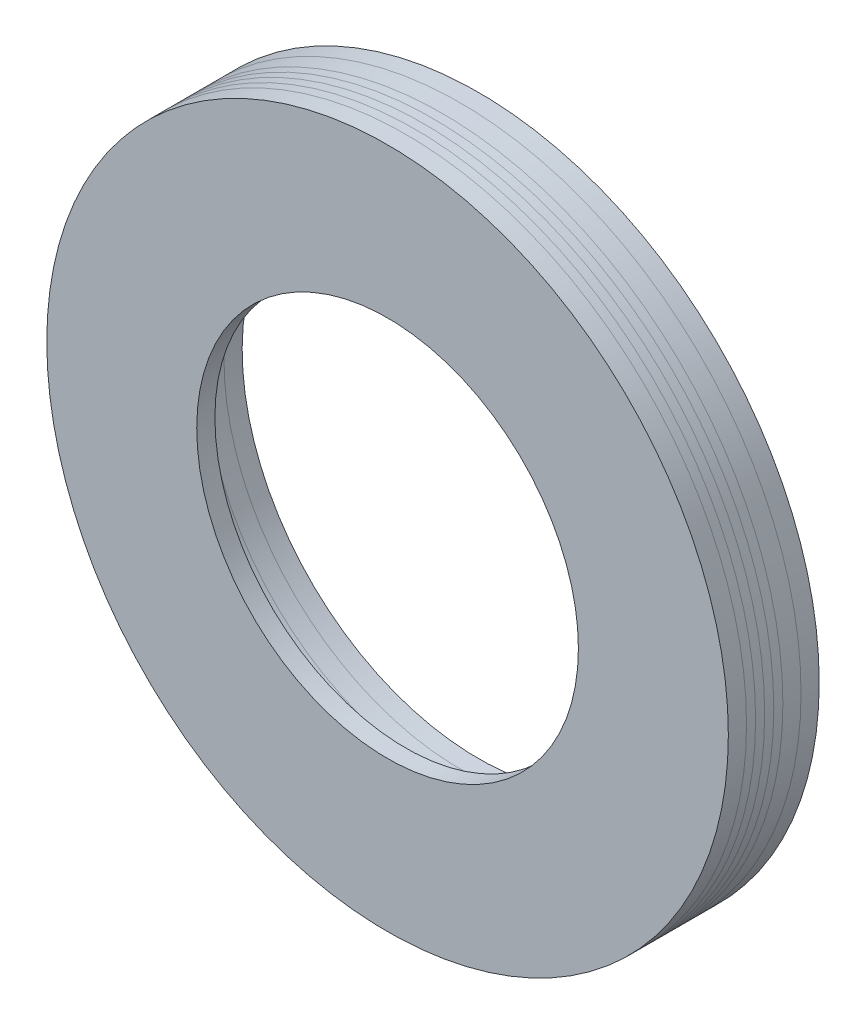
ISO-10303-21;
HEADER;
FILE_DESCRIPTION(('STEP AP214'),'2;1');
FILE_NAME('part.step','',(''),(''),'','','');
FILE_SCHEMA(('AUTOMOTIVE_DESIGN { 1 0 10303 214 1 1 1 1 }'));
ENDSEC;
DATA;
#1=APPLICATION_CONTEXT('core data for automotive mechanical design processes');
#2=APPLICATION_PROTOCOL_DEFINITION('international standard','automotive_design',2000,#1);
#3=PRODUCT_CONTEXT('',#1,'mechanical');
#4=PRODUCT('Part','Part','',(#3));
#5=PRODUCT_RELATED_PRODUCT_CATEGORY('part','',(#4));
#6=PRODUCT_DEFINITION_FORMATION('','',#4);
#7=PRODUCT_DEFINITION_CONTEXT('part definition',#1,'design');
#8=PRODUCT_DEFINITION('design','',#6,#7);
#9=PRODUCT_DEFINITION_SHAPE('','',#8);
#10=(LENGTH_UNIT() NAMED_UNIT(*) SI_UNIT(.MILLI.,.METRE.));
#11=(NAMED_UNIT(*) PLANE_ANGLE_UNIT() SI_UNIT($,.RADIAN.));
#12=(NAMED_UNIT(*) SI_UNIT($,.STERADIAN.) SOLID_ANGLE_UNIT());
#13=UNCERTAINTY_MEASURE_WITH_UNIT(LENGTH_MEASURE(1.E-05),#10,'distance_accuracy_value','');
#14=(GEOMETRIC_REPRESENTATION_CONTEXT(3) GLOBAL_UNCERTAINTY_ASSIGNED_CONTEXT((#13)) GLOBAL_UNIT_ASSIGNED_CONTEXT((#10,
#11,#12)) REPRESENTATION_CONTEXT('',''));
#15=CARTESIAN_POINT('',(0.,0.,0.));
#16=DIRECTION('',(0.,0.,1.));
#17=DIRECTION('',(1.,0.,0.));
#18=AXIS2_PLACEMENT_3D('',#15,#16,#17);
#19=CARTESIAN_POINT('',(0.,0.,5.));
#20=DIRECTION('',(0.,0.,1.));
#21=DIRECTION('',(1.,0.,0.));
#22=AXIS2_PLACEMENT_3D('',#19,#20,#21);
#23=PLANE('',#22);
#24=CARTESIAN_POINT('',(0.,0.,5.));
#25=DIRECTION('',(0.,0.,1.));
#26=DIRECTION('',(1.,0.,0.));
#27=AXIS2_PLACEMENT_3D('',#24,#25,#26);
#28=CIRCLE('',#27,18.75);
#29=CARTESIAN_POINT('',(18.75,0.,5.));
#30=VERTEX_POINT('',#29);
#31=EDGE_CURVE('E11',#30,#30,#28,.T.);
#32=ORIENTED_EDGE('',*,*,#31,.T.);
#33=EDGE_LOOP('',(#32));
#34=FACE_BOUND('',#33,.T.);
#35=CARTESIAN_POINT('',(0.,0.,5.));
#36=DIRECTION('',(0.,0.,1.));
#37=DIRECTION('',(1.,0.,0.));
#38=AXIS2_PLACEMENT_3D('',#35,#36,#37);
#39=CIRCLE('',#38,10.5);
#40=CARTESIAN_POINT('',(10.5,0.,5.));
#41=VERTEX_POINT('',#40);
#42=EDGE_CURVE('E52',#41,#41,#39,.T.);
#43=ORIENTED_EDGE('',*,*,#42,.F.);
#44=EDGE_LOOP('',(#43));
#45=FACE_BOUND('',#44,.T.);
#46=ADVANCED_FACE('F41',(#34,#45),#23,.T.);
#47=CARTESIAN_POINT('',(0.,0.,4.));
#48=DIRECTION('',(0.,0.,1.));
#49=DIRECTION('',(1.,0.,0.));
#50=AXIS2_PLACEMENT_3D('',#47,#48,#49);
#51=PLANE('',#50);
#52=CARTESIAN_POINT('',(0.,0.,4.));
#53=DIRECTION('',(0.,0.,1.));
#54=DIRECTION('',(1.,0.,0.));
#55=AXIS2_PLACEMENT_3D('',#52,#53,#54);
#56=CIRCLE('',#55,18.75);
#57=CARTESIAN_POINT('',(18.75,0.,4.));
#58=VERTEX_POINT('',#57);
#59=EDGE_CURVE('E45',#58,#58,#56,.T.);
#60=ORIENTED_EDGE('',*,*,#59,.F.);
#61=EDGE_LOOP('',(#60));
#62=FACE_BOUND('',#61,.T.);
#63=CARTESIAN_POINT('',(0.,0.,4.));
#64=DIRECTION('',(0.,0.,1.));
#65=DIRECTION('',(1.,0.,0.));
#66=AXIS2_PLACEMENT_3D('',#63,#64,#65);
#67=CIRCLE('',#66,10.5);
#68=CARTESIAN_POINT('',(10.5,0.,4.));
#69=VERTEX_POINT('',#68);
#70=EDGE_CURVE('E54',#69,#69,#67,.T.);
#71=ORIENTED_EDGE('',*,*,#70,.T.);
#72=EDGE_LOOP('',(#71));
#73=FACE_BOUND('',#72,.T.);
#74=ADVANCED_FACE('F64',(#62,#73),#51,.F.);
#75=CARTESIAN_POINT('',(0.,0.,5.));
#76=DIRECTION('',(0.,0.,-1.));
#77=DIRECTION('',(-1.,0.,0.));
#78=AXIS2_PLACEMENT_3D('',#75,#76,#77);
#79=CYLINDRICAL_SURFACE('',#78,18.75);
#80=ORIENTED_EDGE('',*,*,#31,.F.);
#81=EDGE_LOOP('',(#80));
#82=FACE_BOUND('',#81,.T.);
#83=ORIENTED_EDGE('',*,*,#59,.T.);
#84=EDGE_LOOP('',(#83));
#85=FACE_BOUND('',#84,.T.);
#86=ADVANCED_FACE('F43',(#82,#85),#79,.T.);
#87=CARTESIAN_POINT('',(0.,0.,5.));
#88=DIRECTION('',(0.,0.,-1.));
#89=DIRECTION('',(-1.,0.,0.));
#90=AXIS2_PLACEMENT_3D('',#87,#88,#89);
#91=CYLINDRICAL_SURFACE('',#90,10.5);
#92=ORIENTED_EDGE('',*,*,#42,.T.);
#93=EDGE_LOOP('',(#92));
#94=FACE_BOUND('',#93,.T.);
#95=ORIENTED_EDGE('',*,*,#70,.F.);
#96=EDGE_LOOP('',(#95));
#97=FACE_BOUND('',#96,.T.);
#98=ADVANCED_FACE('F60',(#94,#97),#91,.F.);
#99=CLOSED_SHELL('',(#46,#74,#86,#98));
#100=MANIFOLD_SOLID_BREP('B2',#99);
#101=CARTESIAN_POINT('',(-18.75,-18.76,3.5));
#102=DIRECTION('',(0.,0.,1.));
#103=DIRECTION('',(1.,0.,0.));
#104=AXIS2_PLACEMENT_3D('',#101,#102,#103);
#105=PLANE('',#104);
#106=CARTESIAN_POINT('',(0.,0.,3.5));
#107=DIRECTION('',(0.,0.,1.));
#108=DIRECTION('',(1.,0.,0.));
#109=AXIS2_PLACEMENT_3D('',#106,#107,#108);
#110=CIRCLE('',#109,13.);
#111=CARTESIAN_POINT('',(-4.5,12.1963109176505,3.5));
#112=VERTEX_POINT('',#111);
#113=CARTESIAN_POINT('',(4.5,12.1963109176505,3.5));
#114=VERTEX_POINT('',#113);
#115=EDGE_CURVE('E184',#112,#114,#110,.T.);
#116=ORIENTED_EDGE('',*,*,#115,.T.);
#117=DIRECTION('',(0.,1.,0.));
#118=VECTOR('',#117,1.);
#119=CARTESIAN_POINT('',(4.5,16.5,3.5));
#120=LINE('',#119,#118);
#121=CARTESIAN_POINT('',(4.5,16.5,3.5));
#122=VERTEX_POINT('',#121);
#123=EDGE_CURVE('E168',#114,#122,#120,.T.);
#124=ORIENTED_EDGE('',*,*,#123,.T.);
#125=DIRECTION('',(-1.,0.,0.));
#126=VECTOR('',#125,1.);
#127=CARTESIAN_POINT('',(-4.5,16.5,3.5));
#128=LINE('',#127,#126);
#129=CARTESIAN_POINT('',(-4.5,16.5,3.5));
#130=VERTEX_POINT('',#129);
#131=EDGE_CURVE('E164',#122,#130,#128,.T.);
#132=ORIENTED_EDGE('',*,*,#131,.T.);
#133=DIRECTION('',(0.,-1.,0.));
#134=VECTOR('',#133,1.);
#135=CARTESIAN_POINT('',(-4.5,16.5,3.5));
#136=LINE('',#135,#134);
#137=EDGE_CURVE('E154',#130,#112,#136,.T.);
#138=ORIENTED_EDGE('',*,*,#137,.T.);
#139=EDGE_LOOP('',(#116,#124,#132,#138));
#140=FACE_BOUND('',#139,.T.);
#141=CARTESIAN_POINT('',(0.,0.,3.5));
#142=DIRECTION('',(0.,0.,1.));
#143=DIRECTION('',(1.,0.,0.));
#144=AXIS2_PLACEMENT_3D('',#141,#142,#143);
#145=CIRCLE('',#144,18.75);
#146=CARTESIAN_POINT('',(18.75,0.,3.5));
#147=VERTEX_POINT('',#146);
#148=EDGE_CURVE('E116',#147,#147,#145,.T.);
#149=ORIENTED_EDGE('',*,*,#148,.F.);
#150=EDGE_LOOP('',(#149));
#151=FACE_BOUND('',#150,.T.);
#152=ADVANCED_FACE('F112',(#140,#151),#105,.F.);
#153=CARTESIAN_POINT('',(4.5,16.5,4.));
#154=DIRECTION('',(-1.,0.,0.));
#155=DIRECTION('',(0.,-1.,0.));
#156=AXIS2_PLACEMENT_3D('',#153,#154,#155);
#157=PLANE('',#156);
#158=ORIENTED_EDGE('',*,*,#123,.F.);
#159=DIRECTION('',(0.,0.,-1.));
#160=VECTOR('',#159,1.);
#161=CARTESIAN_POINT('',(4.5,12.1963109176505,4.));
#162=LINE('',#161,#160);
#163=CARTESIAN_POINT('',(4.5,12.1963109176505,4.));
#164=VERTEX_POINT('',#163);
#165=EDGE_CURVE('E179',#164,#114,#162,.T.);
#166=ORIENTED_EDGE('',*,*,#165,.F.);
#167=DIRECTION('',(0.,1.,0.));
#168=VECTOR('',#167,1.);
#169=CARTESIAN_POINT('',(4.5,16.5,4.));
#170=LINE('',#169,#168);
#171=CARTESIAN_POINT('',(4.5,16.5,4.));
#172=VERTEX_POINT('',#171);
#173=EDGE_CURVE('E121',#164,#172,#170,.T.);
#174=ORIENTED_EDGE('',*,*,#173,.T.);
#175=DIRECTION('',(0.,0.,-1.));
#176=VECTOR('',#175,1.);
#177=CARTESIAN_POINT('',(4.5,16.5,4.));
#178=LINE('',#177,#176);
#179=EDGE_CURVE('E175',#172,#122,#178,.T.);
#180=ORIENTED_EDGE('',*,*,#179,.T.);
#181=EDGE_LOOP('',(#158,#166,#174,#180));
#182=FACE_BOUND('',#181,.T.);
#183=ADVANCED_FACE('F205',(#182),#157,.T.);
#184=CARTESIAN_POINT('',(0.,0.,4.));
#185=DIRECTION('',(0.,0.,-1.));
#186=DIRECTION('',(-1.,0.,0.));
#187=AXIS2_PLACEMENT_3D('',#184,#185,#186);
#188=CYLINDRICAL_SURFACE('',#187,13.);
#189=ORIENTED_EDGE('',*,*,#115,.F.);
#190=DIRECTION('',(0.,0.,-1.));
#191=VECTOR('',#190,1.);
#192=CARTESIAN_POINT('',(-4.5,12.1963109176505,4.));
#193=LINE('',#192,#191);
#194=CARTESIAN_POINT('',(-4.5,12.1963109176505,4.));
#195=VERTEX_POINT('',#194);
#196=EDGE_CURVE('E160',#195,#112,#193,.T.);
#197=ORIENTED_EDGE('',*,*,#196,.F.);
#198=CARTESIAN_POINT('',(0.,0.,4.));
#199=DIRECTION('',(0.,0.,1.));
#200=DIRECTION('',(1.,0.,0.));
#201=AXIS2_PLACEMENT_3D('',#198,#199,#200);
#202=CIRCLE('',#201,13.);
#203=EDGE_CURVE('E39',#195,#164,#202,.T.);
#204=ORIENTED_EDGE('',*,*,#203,.T.);
#205=ORIENTED_EDGE('',*,*,#165,.T.);
#206=EDGE_LOOP('',(#189,#197,#204,#205));
#207=FACE_BOUND('',#206,.T.);
#208=ADVANCED_FACE('F196',(#207),#188,.F.);
#209=CARTESIAN_POINT('',(0.,0.,4.));
#210=DIRECTION('',(0.,0.,1.));
#211=DIRECTION('',(1.,0.,0.));
#212=AXIS2_PLACEMENT_3D('',#209,#210,#211);
#213=PLANE('',#212);
#214=CARTESIAN_POINT('',(0.,0.,4.));
#215=DIRECTION('',(0.,0.,1.));
#216=DIRECTION('',(1.,0.,0.));
#217=AXIS2_PLACEMENT_3D('',#214,#215,#216);
#218=CIRCLE('',#217,18.75);
#219=CARTESIAN_POINT('',(18.75,0.,4.));
#220=VERTEX_POINT('',#219);
#221=EDGE_CURVE('E182',#220,#220,#218,.T.);
#222=ORIENTED_EDGE('',*,*,#221,.T.);
#223=EDGE_LOOP('',(#222));
#224=FACE_BOUND('',#223,.T.);
#225=ORIENTED_EDGE('',*,*,#173,.F.);
#226=ORIENTED_EDGE('',*,*,#203,.F.);
#227=DIRECTION('',(0.,-1.,0.));
#228=VECTOR('',#227,1.);
#229=CARTESIAN_POINT('',(-4.5,16.5,4.));
#230=LINE('',#229,#228);
#231=CARTESIAN_POINT('',(-4.5,16.5,4.));
#232=VERTEX_POINT('',#231);
#233=EDGE_CURVE('E177',#232,#195,#230,.T.);
#234=ORIENTED_EDGE('',*,*,#233,.F.);
#235=DIRECTION('',(-1.,0.,0.));
#236=VECTOR('',#235,1.);
#237=CARTESIAN_POINT('',(-4.5,16.5,4.));
#238=LINE('',#237,#236);
#239=EDGE_CURVE('E173',#172,#232,#238,.T.);
#240=ORIENTED_EDGE('',*,*,#239,.F.);
#241=EDGE_LOOP('',(#225,#226,#234,#240));
#242=FACE_BOUND('',#241,.T.);
#243=ADVANCED_FACE('F197',(#224,#242),#213,.T.);
#244=CARTESIAN_POINT('',(-4.5,16.5,4.));
#245=DIRECTION('',(0.,-1.,0.));
#246=DIRECTION('',(0.,0.,-1.));
#247=AXIS2_PLACEMENT_3D('',#244,#245,#246);
#248=PLANE('',#247);
#249=ORIENTED_EDGE('',*,*,#131,.F.);
#250=ORIENTED_EDGE('',*,*,#179,.F.);
#251=ORIENTED_EDGE('',*,*,#239,.T.);
#252=DIRECTION('',(0.,0.,-1.));
#253=VECTOR('',#252,1.);
#254=CARTESIAN_POINT('',(-4.5,16.5,4.));
#255=LINE('',#254,#253);
#256=EDGE_CURVE('E158',#232,#130,#255,.T.);
#257=ORIENTED_EDGE('',*,*,#256,.T.);
#258=EDGE_LOOP('',(#249,#250,#251,#257));
#259=FACE_BOUND('',#258,.T.);
#260=ADVANCED_FACE('F171',(#259),#248,.T.);
#261=CARTESIAN_POINT('',(-4.5,16.5,4.));
#262=DIRECTION('',(1.,0.,0.));
#263=DIRECTION('',(0.,1.,0.));
#264=AXIS2_PLACEMENT_3D('',#261,#262,#263);
#265=PLANE('',#264);
#266=ORIENTED_EDGE('',*,*,#137,.F.);
#267=ORIENTED_EDGE('',*,*,#256,.F.);
#268=ORIENTED_EDGE('',*,*,#233,.T.);
#269=ORIENTED_EDGE('',*,*,#196,.T.);
#270=EDGE_LOOP('',(#266,#267,#268,#269));
#271=FACE_BOUND('',#270,.T.);
#272=ADVANCED_FACE('F156',(#271),#265,.T.);
#273=CARTESIAN_POINT('',(0.,0.,4.));
#274=DIRECTION('',(0.,0.,-1.));
#275=DIRECTION('',(-1.,0.,0.));
#276=AXIS2_PLACEMENT_3D('',#273,#274,#275);
#277=CYLINDRICAL_SURFACE('',#276,18.75);
#278=ORIENTED_EDGE('',*,*,#148,.T.);
#279=EDGE_LOOP('',(#278));
#280=FACE_BOUND('',#279,.T.);
#281=ORIENTED_EDGE('',*,*,#221,.F.);
#282=EDGE_LOOP('',(#281));
#283=FACE_BOUND('',#282,.T.);
#284=ADVANCED_FACE('F114',(#280,#283),#277,.T.);
#285=CLOSED_SHELL('',(#152,#183,#208,#243,#260,#272,#284));
#286=MANIFOLD_SOLID_BREP('B6',#285);
#287=CARTESIAN_POINT('',(-18.75,-18.76,3.));
#288=DIRECTION('',(0.,0.,1.));
#289=DIRECTION('',(1.,0.,0.));
#290=AXIS2_PLACEMENT_3D('',#287,#288,#289);
#291=PLANE('',#290);
#292=CARTESIAN_POINT('',(0.,0.,3.));
#293=DIRECTION('',(0.,0.,1.));
#294=DIRECTION('',(1.,0.,0.));
#295=AXIS2_PLACEMENT_3D('',#292,#293,#294);
#296=CIRCLE('',#295,13.);
#297=CARTESIAN_POINT('',(-4.5,12.1963109176505,3.));
#298=VERTEX_POINT('',#297);
#299=CARTESIAN_POINT('',(4.5,12.1963109176505,3.));
#300=VERTEX_POINT('',#299);
#301=EDGE_CURVE('E338',#298,#300,#296,.T.);
#302=ORIENTED_EDGE('',*,*,#301,.T.);
#303=DIRECTION('',(0.,1.,0.));
#304=VECTOR('',#303,1.);
#305=CARTESIAN_POINT('',(4.5,16.5,3.));
#306=LINE('',#305,#304);
#307=CARTESIAN_POINT('',(4.5,16.5,3.));
#308=VERTEX_POINT('',#307);
#309=EDGE_CURVE('E316',#300,#308,#306,.T.);
#310=ORIENTED_EDGE('',*,*,#309,.T.);
#311=DIRECTION('',(-1.,0.,0.));
#312=VECTOR('',#311,1.);
#313=CARTESIAN_POINT('',(-4.5,16.5,3.));
#314=LINE('',#313,#312);
#315=CARTESIAN_POINT('',(-4.5,16.5,3.));
#316=VERTEX_POINT('',#315);
#317=EDGE_CURVE('E312',#308,#316,#314,.T.);
#318=ORIENTED_EDGE('',*,*,#317,.T.);
#319=DIRECTION('',(0.,-1.,0.));
#320=VECTOR('',#319,1.);
#321=CARTESIAN_POINT('',(-4.5,16.5,3.));
#322=LINE('',#321,#320);
#323=EDGE_CURVE('E304',#316,#298,#322,.T.);
#324=ORIENTED_EDGE('',*,*,#323,.T.);
#325=EDGE_LOOP('',(#302,#310,#318,#324));
#326=FACE_BOUND('',#325,.T.);
#327=CARTESIAN_POINT('',(0.,0.,3.));
#328=DIRECTION('',(0.,0.,1.));
#329=DIRECTION('',(1.,0.,0.));
#330=AXIS2_PLACEMENT_3D('',#327,#328,#329);
#331=CIRCLE('',#330,18.75);
#332=CARTESIAN_POINT('',(18.75,0.,3.));
#333=VERTEX_POINT('',#332);
#334=EDGE_CURVE('E339',#333,#333,#331,.T.);
#335=ORIENTED_EDGE('',*,*,#334,.F.);
#336=EDGE_LOOP('',(#335));
#337=FACE_BOUND('',#336,.T.);
#338=ADVANCED_FACE('F266',(#326,#337),#291,.F.);
#339=CARTESIAN_POINT('',(-18.75,-18.76,3.5));
#340=DIRECTION('',(0.,0.,1.));
#341=DIRECTION('',(1.,0.,0.));
#342=AXIS2_PLACEMENT_3D('',#339,#340,#341);
#343=PLANE('',#342);
#344=CARTESIAN_POINT('',(0.,0.,3.5));
#345=DIRECTION('',(0.,0.,1.));
#346=DIRECTION('',(1.,0.,0.));
#347=AXIS2_PLACEMENT_3D('',#344,#345,#346);
#348=CIRCLE('',#347,18.75);
#349=CARTESIAN_POINT('',(18.75,0.,3.5));
#350=VERTEX_POINT('',#349);
#351=EDGE_CURVE('E270',#350,#350,#348,.T.);
#352=ORIENTED_EDGE('',*,*,#351,.T.);
#353=EDGE_LOOP('',(#352));
#354=FACE_BOUND('',#353,.T.);
#355=CARTESIAN_POINT('',(0.,0.,3.5));
#356=DIRECTION('',(0.,0.,1.));
#357=DIRECTION('',(1.,0.,0.));
#358=AXIS2_PLACEMENT_3D('',#355,#356,#357);
#359=CIRCLE('',#358,13.);
#360=CARTESIAN_POINT('',(-4.5,12.1963109176505,3.5));
#361=VERTEX_POINT('',#360);
#362=CARTESIAN_POINT('',(4.5,12.1963109176505,3.5));
#363=VERTEX_POINT('',#362);
#364=EDGE_CURVE('E341',#361,#363,#359,.T.);
#365=ORIENTED_EDGE('',*,*,#364,.F.);
#366=DIRECTION('',(0.,-1.,0.));
#367=VECTOR('',#366,1.);
#368=CARTESIAN_POINT('',(-4.5,16.5,3.5));
#369=LINE('',#368,#367);
#370=CARTESIAN_POINT('',(-4.5,16.5,3.5));
#371=VERTEX_POINT('',#370);
#372=EDGE_CURVE('E283',#371,#361,#369,.T.);
#373=ORIENTED_EDGE('',*,*,#372,.F.);
#374=DIRECTION('',(-1.,0.,0.));
#375=VECTOR('',#374,1.);
#376=CARTESIAN_POINT('',(-4.5,16.5,3.5));
#377=LINE('',#376,#375);
#378=CARTESIAN_POINT('',(4.5,16.5,3.5));
#379=VERTEX_POINT('',#378);
#380=EDGE_CURVE('E322',#379,#371,#377,.T.);
#381=ORIENTED_EDGE('',*,*,#380,.F.);
#382=DIRECTION('',(0.,1.,0.));
#383=VECTOR('',#382,1.);
#384=CARTESIAN_POINT('',(4.5,16.5,3.5));
#385=LINE('',#384,#383);
#386=EDGE_CURVE('E333',#363,#379,#385,.T.);
#387=ORIENTED_EDGE('',*,*,#386,.F.);
#388=EDGE_LOOP('',(#365,#373,#381,#387));
#389=FACE_BOUND('',#388,.T.);
#390=ADVANCED_FACE('F348',(#354,#389),#343,.T.);
#391=CARTESIAN_POINT('',(4.5,16.5,4.));
#392=DIRECTION('',(-1.,0.,0.));
#393=DIRECTION('',(0.,-1.,0.));
#394=AXIS2_PLACEMENT_3D('',#391,#392,#393);
#395=PLANE('',#394);
#396=DIRECTION('',(0.,0.,-1.));
#397=VECTOR('',#396,1.);
#398=CARTESIAN_POINT('',(4.5,12.1963109176505,4.));
#399=LINE('',#398,#397);
#400=EDGE_CURVE('E325',#363,#300,#399,.T.);
#401=ORIENTED_EDGE('',*,*,#400,.F.);
#402=ORIENTED_EDGE('',*,*,#386,.T.);
#403=DIRECTION('',(0.,0.,-1.));
#404=VECTOR('',#403,1.);
#405=CARTESIAN_POINT('',(4.5,16.5,4.));
#406=LINE('',#405,#404);
#407=EDGE_CURVE('E323',#379,#308,#406,.T.);
#408=ORIENTED_EDGE('',*,*,#407,.T.);
#409=ORIENTED_EDGE('',*,*,#309,.F.);
#410=EDGE_LOOP('',(#401,#402,#408,#409));
#411=FACE_BOUND('',#410,.T.);
#412=ADVANCED_FACE('F351',(#411),#395,.T.);
#413=CARTESIAN_POINT('',(0.,0.,4.));
#414=DIRECTION('',(0.,0.,-1.));
#415=DIRECTION('',(-1.,0.,0.));
#416=AXIS2_PLACEMENT_3D('',#413,#414,#415);
#417=CYLINDRICAL_SURFACE('',#416,13.);
#418=DIRECTION('',(0.,0.,-1.));
#419=VECTOR('',#418,1.);
#420=CARTESIAN_POINT('',(-4.5,12.1963109176505,4.));
#421=LINE('',#420,#419);
#422=EDGE_CURVE('E110',#361,#298,#421,.T.);
#423=ORIENTED_EDGE('',*,*,#422,.F.);
#424=ORIENTED_EDGE('',*,*,#364,.T.);
#425=ORIENTED_EDGE('',*,*,#400,.T.);
#426=ORIENTED_EDGE('',*,*,#301,.F.);
#427=EDGE_LOOP('',(#423,#424,#425,#426));
#428=FACE_BOUND('',#427,.T.);
#429=ADVANCED_FACE('F356',(#428),#417,.F.);
#430=CARTESIAN_POINT('',(-4.5,16.5,4.));
#431=DIRECTION('',(0.,-1.,0.));
#432=DIRECTION('',(0.,0.,-1.));
#433=AXIS2_PLACEMENT_3D('',#430,#431,#432);
#434=PLANE('',#433);
#435=ORIENTED_EDGE('',*,*,#407,.F.);
#436=ORIENTED_EDGE('',*,*,#380,.T.);
#437=DIRECTION('',(0.,0.,-1.));
#438=VECTOR('',#437,1.);
#439=CARTESIAN_POINT('',(-4.5,16.5,4.));
#440=LINE('',#439,#438);
#441=EDGE_CURVE('E275',#371,#316,#440,.T.);
#442=ORIENTED_EDGE('',*,*,#441,.T.);
#443=ORIENTED_EDGE('',*,*,#317,.F.);
#444=EDGE_LOOP('',(#435,#436,#442,#443));
#445=FACE_BOUND('',#444,.T.);
#446=ADVANCED_FACE('F321',(#445),#434,.T.);
#447=CARTESIAN_POINT('',(-4.5,16.5,4.));
#448=DIRECTION('',(1.,0.,0.));
#449=DIRECTION('',(0.,1.,0.));
#450=AXIS2_PLACEMENT_3D('',#447,#448,#449);
#451=PLANE('',#450);
#452=ORIENTED_EDGE('',*,*,#441,.F.);
#453=ORIENTED_EDGE('',*,*,#372,.T.);
#454=ORIENTED_EDGE('',*,*,#422,.T.);
#455=ORIENTED_EDGE('',*,*,#323,.F.);
#456=EDGE_LOOP('',(#452,#453,#454,#455));
#457=FACE_BOUND('',#456,.T.);
#458=ADVANCED_FACE('F306',(#457),#451,.T.);
#459=CARTESIAN_POINT('',(0.,0.,4.));
#460=DIRECTION('',(0.,0.,-1.));
#461=DIRECTION('',(-1.,0.,0.));
#462=AXIS2_PLACEMENT_3D('',#459,#460,#461);
#463=CYLINDRICAL_SURFACE('',#462,18.75);
#464=ORIENTED_EDGE('',*,*,#334,.T.);
#465=EDGE_LOOP('',(#464));
#466=FACE_BOUND('',#465,.T.);
#467=ORIENTED_EDGE('',*,*,#351,.F.);
#468=EDGE_LOOP('',(#467));
#469=FACE_BOUND('',#468,.T.);
#470=ADVANCED_FACE('F268',(#466,#469),#463,.T.);
#471=CLOSED_SHELL('',(#338,#390,#412,#429,#446,#458,#470));
#472=MANIFOLD_SOLID_BREP('B33',#471);
#473=CARTESIAN_POINT('',(-18.75,-18.76,1.));
#474=DIRECTION('',(0.,0.,1.));
#475=DIRECTION('',(1.,0.,0.));
#476=AXIS2_PLACEMENT_3D('',#473,#474,#475);
#477=PLANE('',#476);
#478=CARTESIAN_POINT('',(0.,0.,1.));
#479=DIRECTION('',(0.,0.,1.));
#480=DIRECTION('',(1.,0.,0.));
#481=AXIS2_PLACEMENT_3D('',#478,#479,#480);
#482=CIRCLE('',#481,18.75);
#483=CARTESIAN_POINT('',(18.75,0.,1.));
#484=VERTEX_POINT('',#483);
#485=EDGE_CURVE('E472',#484,#484,#482,.T.);
#486=ORIENTED_EDGE('',*,*,#485,.T.);
#487=EDGE_LOOP('',(#486));
#488=FACE_BOUND('',#487,.T.);
#489=CARTESIAN_POINT('',(0.,0.,1.));
#490=DIRECTION('',(0.,0.,1.));
#491=DIRECTION('',(1.,0.,0.));
#492=AXIS2_PLACEMENT_3D('',#489,#490,#491);
#493=CIRCLE('',#492,13.);
#494=CARTESIAN_POINT('',(-4.5,12.1963109176505,1.));
#495=VERTEX_POINT('',#494);
#496=CARTESIAN_POINT('',(4.5,12.1963109176505,1.));
#497=VERTEX_POINT('',#496);
#498=EDGE_CURVE('E465',#495,#497,#493,.T.);
#499=ORIENTED_EDGE('',*,*,#498,.F.);
#500=DIRECTION('',(0.,-1.,0.));
#501=VECTOR('',#500,1.);
#502=CARTESIAN_POINT('',(-4.5,16.5,1.));
#503=LINE('',#502,#501);
#504=CARTESIAN_POINT('',(-4.5,16.5,1.));
#505=VERTEX_POINT('',#504);
#506=EDGE_CURVE('E479',#505,#495,#503,.T.);
#507=ORIENTED_EDGE('',*,*,#506,.F.);
#508=DIRECTION('',(-1.,0.,0.));
#509=VECTOR('',#508,1.);
#510=CARTESIAN_POINT('',(-4.5,16.5,1.));
#511=LINE('',#510,#509);
#512=CARTESIAN_POINT('',(4.5,16.5,1.));
#513=VERTEX_POINT('',#512);
#514=EDGE_CURVE('E468',#513,#505,#511,.T.);
#515=ORIENTED_EDGE('',*,*,#514,.F.);
#516=DIRECTION('',(0.,1.,0.));
#517=VECTOR('',#516,1.);
#518=CARTESIAN_POINT('',(4.5,16.5,1.));
#519=LINE('',#518,#517);
#520=EDGE_CURVE('E464',#497,#513,#519,.T.);
#521=ORIENTED_EDGE('',*,*,#520,.F.);
#522=EDGE_LOOP('',(#499,#507,#515,#521));
#523=FACE_BOUND('',#522,.T.);
#524=ADVANCED_FACE('F420',(#488,#523),#477,.T.);
#525=CARTESIAN_POINT('',(4.5,16.5,4.));
#526=DIRECTION('',(-1.,0.,0.));
#527=DIRECTION('',(0.,-1.,0.));
#528=AXIS2_PLACEMENT_3D('',#525,#526,#527);
#529=PLANE('',#528);
#530=DIRECTION('',(0.,0.,-1.));
#531=VECTOR('',#530,1.);
#532=CARTESIAN_POINT('',(4.5,12.1963109176505,4.));
#533=LINE('',#532,#531);
#534=CARTESIAN_POINT('',(4.5,12.1963109176505,0.));
#535=VERTEX_POINT('',#534);
#536=EDGE_CURVE('E424',#497,#535,#533,.T.);
#537=ORIENTED_EDGE('',*,*,#536,.F.);
#538=ORIENTED_EDGE('',*,*,#520,.T.);
#539=DIRECTION('',(0.,0.,-1.));
#540=VECTOR('',#539,1.);
#541=CARTESIAN_POINT('',(4.5,16.5,4.));
#542=LINE('',#541,#540);
#543=CARTESIAN_POINT('',(4.5,16.5,0.));
#544=VERTEX_POINT('',#543);
#545=EDGE_CURVE('E443',#513,#544,#542,.T.);
#546=ORIENTED_EDGE('',*,*,#545,.T.);
#547=DIRECTION('',(0.,1.,0.));
#548=VECTOR('',#547,1.);
#549=CARTESIAN_POINT('',(4.5,16.5,0.));
#550=LINE('',#549,#548);
#551=EDGE_CURVE('E429',#535,#544,#550,.T.);
#552=ORIENTED_EDGE('',*,*,#551,.F.);
#553=EDGE_LOOP('',(#537,#538,#546,#552));
#554=FACE_BOUND('',#553,.T.);
#555=ADVANCED_FACE('F474',(#554),#529,.T.);
#556=CARTESIAN_POINT('',(0.,0.,0.));
#557=DIRECTION('',(0.,0.,1.));
#558=DIRECTION('',(1.,0.,0.));
#559=AXIS2_PLACEMENT_3D('',#556,#557,#558);
#560=PLANE('',#559);
#561=CARTESIAN_POINT('',(0.,0.,0.));
#562=DIRECTION('',(0.,0.,1.));
#563=DIRECTION('',(1.,0.,0.));
#564=AXIS2_PLACEMENT_3D('',#561,#562,#563);
#565=CIRCLE('',#564,18.75);
#566=CARTESIAN_POINT('',(18.75,0.,0.));
#567=VERTEX_POINT('',#566);
#568=EDGE_CURVE('E476',#567,#567,#565,.T.);
#569=ORIENTED_EDGE('',*,*,#568,.F.);
#570=EDGE_LOOP('',(#569));
#571=FACE_BOUND('',#570,.T.);
#572=CARTESIAN_POINT('',(0.,0.,0.));
#573=DIRECTION('',(0.,0.,1.));
#574=DIRECTION('',(1.,0.,0.));
#575=AXIS2_PLACEMENT_3D('',#572,#573,#574);
#576=CIRCLE('',#575,13.);
#577=CARTESIAN_POINT('',(-4.5,12.1963109176505,0.));
#578=VERTEX_POINT('',#577);
#579=EDGE_CURVE('E264',#578,#535,#576,.T.);
#580=ORIENTED_EDGE('',*,*,#579,.T.);
#581=ORIENTED_EDGE('',*,*,#551,.T.);
#582=DIRECTION('',(-1.,0.,0.));
#583=VECTOR('',#582,1.);
#584=CARTESIAN_POINT('',(-4.5,16.5,0.));
#585=LINE('',#584,#583);
#586=CARTESIAN_POINT('',(-4.5,16.5,0.));
#587=VERTEX_POINT('',#586);
#588=EDGE_CURVE('E488',#544,#587,#585,.T.);
#589=ORIENTED_EDGE('',*,*,#588,.T.);
#590=DIRECTION('',(0.,-1.,0.));
#591=VECTOR('',#590,1.);
#592=CARTESIAN_POINT('',(-4.5,16.5,0.));
#593=LINE('',#592,#591);
#594=EDGE_CURVE('E485',#587,#578,#593,.T.);
#595=ORIENTED_EDGE('',*,*,#594,.T.);
#596=EDGE_LOOP('',(#580,#581,#589,#595));
#597=FACE_BOUND('',#596,.T.);
#598=ADVANCED_FACE('F503',(#571,#597),#560,.F.);
#599=CARTESIAN_POINT('',(0.,0.,4.));
#600=DIRECTION('',(0.,0.,-1.));
#601=DIRECTION('',(-1.,0.,0.));
#602=AXIS2_PLACEMENT_3D('',#599,#600,#601);
#603=CYLINDRICAL_SURFACE('',#602,13.);
#604=DIRECTION('',(0.,0.,-1.));
#605=VECTOR('',#604,1.);
#606=CARTESIAN_POINT('',(-4.5,12.1963109176505,4.));
#607=LINE('',#606,#605);
#608=EDGE_CURVE('E471',#495,#578,#607,.T.);
#609=ORIENTED_EDGE('',*,*,#608,.F.);
#610=ORIENTED_EDGE('',*,*,#498,.T.);
#611=ORIENTED_EDGE('',*,*,#536,.T.);
#612=ORIENTED_EDGE('',*,*,#579,.F.);
#613=EDGE_LOOP('',(#609,#610,#611,#612));
#614=FACE_BOUND('',#613,.T.);
#615=ADVANCED_FACE('F470',(#614),#603,.F.);
#616=CARTESIAN_POINT('',(-4.5,16.5,4.));
#617=DIRECTION('',(0.,-1.,0.));
#618=DIRECTION('',(0.,0.,-1.));
#619=AXIS2_PLACEMENT_3D('',#616,#617,#618);
#620=PLANE('',#619);
#621=ORIENTED_EDGE('',*,*,#545,.F.);
#622=ORIENTED_EDGE('',*,*,#514,.T.);
#623=DIRECTION('',(0.,0.,-1.));
#624=VECTOR('',#623,1.);
#625=CARTESIAN_POINT('',(-4.5,16.5,4.));
#626=LINE('',#625,#624);
#627=EDGE_CURVE('E477',#505,#587,#626,.T.);
#628=ORIENTED_EDGE('',*,*,#627,.T.);
#629=ORIENTED_EDGE('',*,*,#588,.F.);
#630=EDGE_LOOP('',(#621,#622,#628,#629));
#631=FACE_BOUND('',#630,.T.);
#632=ADVANCED_FACE('F499',(#631),#620,.T.);
#633=CARTESIAN_POINT('',(-4.5,16.5,4.));
#634=DIRECTION('',(1.,0.,0.));
#635=DIRECTION('',(0.,1.,0.));
#636=AXIS2_PLACEMENT_3D('',#633,#634,#635);
#637=PLANE('',#636);
#638=ORIENTED_EDGE('',*,*,#627,.F.);
#639=ORIENTED_EDGE('',*,*,#506,.T.);
#640=ORIENTED_EDGE('',*,*,#608,.T.);
#641=ORIENTED_EDGE('',*,*,#594,.F.);
#642=EDGE_LOOP('',(#638,#639,#640,#641));
#643=FACE_BOUND('',#642,.T.);
#644=ADVANCED_FACE('F501',(#643),#637,.T.);
#645=CARTESIAN_POINT('',(0.,0.,4.));
#646=DIRECTION('',(0.,0.,-1.));
#647=DIRECTION('',(-1.,0.,0.));
#648=AXIS2_PLACEMENT_3D('',#645,#646,#647);
#649=CYLINDRICAL_SURFACE('',#648,18.75);
#650=ORIENTED_EDGE('',*,*,#568,.T.);
#651=EDGE_LOOP('',(#650));
#652=FACE_BOUND('',#651,.T.);
#653=ORIENTED_EDGE('',*,*,#485,.F.);
#654=EDGE_LOOP('',(#653));
#655=FACE_BOUND('',#654,.T.);
#656=ADVANCED_FACE('F422',(#652,#655),#649,.T.);
#657=CLOSED_SHELL('',(#524,#555,#598,#615,#632,#644,#656));
#658=MANIFOLD_SOLID_BREP('B104',#657);
#659=CARTESIAN_POINT('',(-18.75,-18.76,2.5));
#660=DIRECTION('',(0.,0.,1.));
#661=DIRECTION('',(1.,0.,0.));
#662=AXIS2_PLACEMENT_3D('',#659,#660,#661);
#663=PLANE('',#662);
#664=CARTESIAN_POINT('',(0.,0.,2.5));
#665=DIRECTION('',(0.,0.,1.));
#666=DIRECTION('',(1.,0.,0.));
#667=AXIS2_PLACEMENT_3D('',#664,#665,#666);
#668=CIRCLE('',#667,13.);
#669=CARTESIAN_POINT('',(-4.5,12.1963109176505,2.5));
#670=VERTEX_POINT('',#669);
#671=CARTESIAN_POINT('',(4.5,12.1963109176505,2.5));
#672=VERTEX_POINT('',#671);
#673=EDGE_CURVE('E648',#670,#672,#668,.T.);
#674=ORIENTED_EDGE('',*,*,#673,.T.);
#675=DIRECTION('',(0.,1.,0.));
#676=VECTOR('',#675,1.);
#677=CARTESIAN_POINT('',(4.5,16.5,2.5));
#678=LINE('',#677,#676);
#679=CARTESIAN_POINT('',(4.5,16.5,2.5));
#680=VERTEX_POINT('',#679);
#681=EDGE_CURVE('E624',#672,#680,#678,.T.);
#682=ORIENTED_EDGE('',*,*,#681,.T.);
#683=DIRECTION('',(-1.,0.,0.));
#684=VECTOR('',#683,1.);
#685=CARTESIAN_POINT('',(-4.5,16.5,2.5));
#686=LINE('',#685,#684);
#687=CARTESIAN_POINT('',(-4.5,16.5,2.5));
#688=VERTEX_POINT('',#687);
#689=EDGE_CURVE('E620',#680,#688,#686,.T.);
#690=ORIENTED_EDGE('',*,*,#689,.T.);
#691=DIRECTION('',(0.,-1.,0.));
#692=VECTOR('',#691,1.);
#693=CARTESIAN_POINT('',(-4.5,16.5,2.5));
#694=LINE('',#693,#692);
#695=EDGE_CURVE('E612',#688,#670,#694,.T.);
#696=ORIENTED_EDGE('',*,*,#695,.T.);
#697=EDGE_LOOP('',(#674,#682,#690,#696));
#698=FACE_BOUND('',#697,.T.);
#699=CARTESIAN_POINT('',(0.,0.,2.5));
#700=DIRECTION('',(0.,0.,1.));
#701=DIRECTION('',(1.,0.,0.));
#702=AXIS2_PLACEMENT_3D('',#699,#700,#701);
#703=CIRCLE('',#702,18.75);
#704=CARTESIAN_POINT('',(18.75,0.,2.5));
#705=VERTEX_POINT('',#704);
#706=EDGE_CURVE('E644',#705,#705,#703,.T.);
#707=ORIENTED_EDGE('',*,*,#706,.F.);
#708=EDGE_LOOP('',(#707));
#709=FACE_BOUND('',#708,.T.);
#710=ADVANCED_FACE('F574',(#698,#709),#663,.F.);
#711=CARTESIAN_POINT('',(-18.75,-18.76,3.));
#712=DIRECTION('',(0.,0.,1.));
#713=DIRECTION('',(1.,0.,0.));
#714=AXIS2_PLACEMENT_3D('',#711,#712,#713);
#715=PLANE('',#714);
#716=CARTESIAN_POINT('',(0.,0.,3.));
#717=DIRECTION('',(0.,0.,1.));
#718=DIRECTION('',(1.,0.,0.));
#719=AXIS2_PLACEMENT_3D('',#716,#717,#718);
#720=CIRCLE('',#719,18.75);
#721=CARTESIAN_POINT('',(18.75,0.,3.));
#722=VERTEX_POINT('',#721);
#723=EDGE_CURVE('E578',#722,#722,#720,.T.);
#724=ORIENTED_EDGE('',*,*,#723,.T.);
#725=EDGE_LOOP('',(#724));
#726=FACE_BOUND('',#725,.T.);
#727=CARTESIAN_POINT('',(0.,0.,3.));
#728=DIRECTION('',(0.,0.,1.));
#729=DIRECTION('',(1.,0.,0.));
#730=AXIS2_PLACEMENT_3D('',#727,#728,#729);
#731=CIRCLE('',#730,13.);
#732=CARTESIAN_POINT('',(-4.5,12.1963109176505,3.));
#733=VERTEX_POINT('',#732);
#734=CARTESIAN_POINT('',(4.5,12.1963109176505,3.));
#735=VERTEX_POINT('',#734);
#736=EDGE_CURVE('E647',#733,#735,#731,.T.);
#737=ORIENTED_EDGE('',*,*,#736,.F.);
#738=DIRECTION('',(0.,-1.,0.));
#739=VECTOR('',#738,1.);
#740=CARTESIAN_POINT('',(-4.5,16.5,3.));
#741=LINE('',#740,#739);
#742=CARTESIAN_POINT('',(-4.5,16.5,3.));
#743=VERTEX_POINT('',#742);
#744=EDGE_CURVE('E591',#743,#733,#741,.T.);
#745=ORIENTED_EDGE('',*,*,#744,.F.);
#746=DIRECTION('',(-1.,0.,0.));
#747=VECTOR('',#746,1.);
#748=CARTESIAN_POINT('',(-4.5,16.5,3.));
#749=LINE('',#748,#747);
#750=CARTESIAN_POINT('',(4.5,16.5,3.));
#751=VERTEX_POINT('',#750);
#752=EDGE_CURVE('E630',#751,#743,#749,.T.);
#753=ORIENTED_EDGE('',*,*,#752,.F.);
#754=DIRECTION('',(0.,1.,0.));
#755=VECTOR('',#754,1.);
#756=CARTESIAN_POINT('',(4.5,16.5,3.));
#757=LINE('',#756,#755);
#758=EDGE_CURVE('E640',#735,#751,#757,.T.);
#759=ORIENTED_EDGE('',*,*,#758,.F.);
#760=EDGE_LOOP('',(#737,#745,#753,#759));
#761=FACE_BOUND('',#760,.T.);
#762=ADVANCED_FACE('F653',(#726,#761),#715,.T.);
#763=CARTESIAN_POINT('',(4.5,16.5,4.));
#764=DIRECTION('',(-1.,0.,0.));
#765=DIRECTION('',(0.,-1.,0.));
#766=AXIS2_PLACEMENT_3D('',#763,#764,#765);
#767=PLANE('',#766);
#768=DIRECTION('',(0.,0.,-1.));
#769=VECTOR('',#768,1.);
#770=CARTESIAN_POINT('',(4.5,12.1963109176505,4.));
#771=LINE('',#770,#769);
#772=EDGE_CURVE('E633',#735,#672,#771,.T.);
#773=ORIENTED_EDGE('',*,*,#772,.F.);
#774=ORIENTED_EDGE('',*,*,#758,.T.);
#775=DIRECTION('',(0.,0.,-1.));
#776=VECTOR('',#775,1.);
#777=CARTESIAN_POINT('',(4.5,16.5,4.));
#778=LINE('',#777,#776);
#779=EDGE_CURVE('E631',#751,#680,#778,.T.);
#780=ORIENTED_EDGE('',*,*,#779,.T.);
#781=ORIENTED_EDGE('',*,*,#681,.F.);
#782=EDGE_LOOP('',(#773,#774,#780,#781));
#783=FACE_BOUND('',#782,.T.);
#784=ADVANCED_FACE('F657',(#783),#767,.T.);
#785=CARTESIAN_POINT('',(0.,0.,4.));
#786=DIRECTION('',(0.,0.,-1.));
#787=DIRECTION('',(-1.,0.,0.));
#788=AXIS2_PLACEMENT_3D('',#785,#786,#787);
#789=CYLINDRICAL_SURFACE('',#788,13.);
#790=DIRECTION('',(0.,0.,-1.));
#791=VECTOR('',#790,1.);
#792=CARTESIAN_POINT('',(-4.5,12.1963109176505,4.));
#793=LINE('',#792,#791);
#794=EDGE_CURVE('E418',#733,#670,#793,.T.);
#795=ORIENTED_EDGE('',*,*,#794,.F.);
#796=ORIENTED_EDGE('',*,*,#736,.T.);
#797=ORIENTED_EDGE('',*,*,#772,.T.);
#798=ORIENTED_EDGE('',*,*,#673,.F.);
#799=EDGE_LOOP('',(#795,#796,#797,#798));
#800=FACE_BOUND('',#799,.T.);
#801=ADVANCED_FACE('F662',(#800),#789,.F.);
#802=CARTESIAN_POINT('',(-4.5,16.5,4.));
#803=DIRECTION('',(0.,-1.,0.));
#804=DIRECTION('',(0.,0.,-1.));
#805=AXIS2_PLACEMENT_3D('',#802,#803,#804);
#806=PLANE('',#805);
#807=ORIENTED_EDGE('',*,*,#779,.F.);
#808=ORIENTED_EDGE('',*,*,#752,.T.);
#809=DIRECTION('',(0.,0.,-1.));
#810=VECTOR('',#809,1.);
#811=CARTESIAN_POINT('',(-4.5,16.5,4.));
#812=LINE('',#811,#810);
#813=EDGE_CURVE('E583',#743,#688,#812,.T.);
#814=ORIENTED_EDGE('',*,*,#813,.T.);
#815=ORIENTED_EDGE('',*,*,#689,.F.);
#816=EDGE_LOOP('',(#807,#808,#814,#815));
#817=FACE_BOUND('',#816,.T.);
#818=ADVANCED_FACE('F629',(#817),#806,.T.);
#819=CARTESIAN_POINT('',(-4.5,16.5,4.));
#820=DIRECTION('',(1.,0.,0.));
#821=DIRECTION('',(0.,1.,0.));
#822=AXIS2_PLACEMENT_3D('',#819,#820,#821);
#823=PLANE('',#822);
#824=ORIENTED_EDGE('',*,*,#813,.F.);
#825=ORIENTED_EDGE('',*,*,#744,.T.);
#826=ORIENTED_EDGE('',*,*,#794,.T.);
#827=ORIENTED_EDGE('',*,*,#695,.F.);
#828=EDGE_LOOP('',(#824,#825,#826,#827));
#829=FACE_BOUND('',#828,.T.);
#830=ADVANCED_FACE('F614',(#829),#823,.T.);
#831=CARTESIAN_POINT('',(0.,0.,4.));
#832=DIRECTION('',(0.,0.,-1.));
#833=DIRECTION('',(-1.,0.,0.));
#834=AXIS2_PLACEMENT_3D('',#831,#832,#833);
#835=CYLINDRICAL_SURFACE('',#834,18.75);
#836=ORIENTED_EDGE('',*,*,#706,.T.);
#837=EDGE_LOOP('',(#836));
#838=FACE_BOUND('',#837,.T.);
#839=ORIENTED_EDGE('',*,*,#723,.F.);
#840=EDGE_LOOP('',(#839));
#841=FACE_BOUND('',#840,.T.);
#842=ADVANCED_FACE('F576',(#838,#841),#835,.T.);
#843=CLOSED_SHELL('',(#710,#762,#784,#801,#818,#830,#842));
#844=MANIFOLD_SOLID_BREP('B258',#843);
#845=CARTESIAN_POINT('',(-18.75,-18.76,1.));
#846=DIRECTION('',(0.,0.,1.));
#847=DIRECTION('',(1.,0.,0.));
#848=AXIS2_PLACEMENT_3D('',#845,#846,#847);
#849=PLANE('',#848);
#850=CARTESIAN_POINT('',(0.,0.,1.));
#851=DIRECTION('',(0.,0.,1.));
#852=DIRECTION('',(1.,0.,0.));
#853=AXIS2_PLACEMENT_3D('',#850,#851,#852);
#854=CIRCLE('',#853,13.);
#855=CARTESIAN_POINT('',(-4.5,12.1963109176505,1.));
#856=VERTEX_POINT('',#855);
#857=CARTESIAN_POINT('',(4.5,12.1963109176505,1.));
#858=VERTEX_POINT('',#857);
#859=EDGE_CURVE('E789',#856,#858,#854,.T.);
#860=ORIENTED_EDGE('',*,*,#859,.T.);
#861=DIRECTION('',(0.,1.,0.));
#862=VECTOR('',#861,1.);
#863=CARTESIAN_POINT('',(4.5,16.5,1.));
#864=LINE('',#863,#862);
#865=CARTESIAN_POINT('',(4.5,16.5,1.));
#866=VERTEX_POINT('',#865);
#867=EDGE_CURVE('E775',#858,#866,#864,.T.);
#868=ORIENTED_EDGE('',*,*,#867,.T.);
#869=DIRECTION('',(-1.,0.,0.));
#870=VECTOR('',#869,1.);
#871=CARTESIAN_POINT('',(-4.5,16.5,1.));
#872=LINE('',#871,#870);
#873=CARTESIAN_POINT('',(-4.5,16.5,1.));
#874=VERTEX_POINT('',#873);
#875=EDGE_CURVE('E772',#866,#874,#872,.T.);
#876=ORIENTED_EDGE('',*,*,#875,.T.);
#877=DIRECTION('',(0.,-1.,0.));
#878=VECTOR('',#877,1.);
#879=CARTESIAN_POINT('',(-4.5,16.5,1.));
#880=LINE('',#879,#878);
#881=EDGE_CURVE('E731',#874,#856,#880,.T.);
#882=ORIENTED_EDGE('',*,*,#881,.T.);
#883=EDGE_LOOP('',(#860,#868,#876,#882));
#884=FACE_BOUND('',#883,.T.);
#885=CARTESIAN_POINT('',(0.,0.,1.));
#886=DIRECTION('',(0.,0.,1.));
#887=DIRECTION('',(1.,0.,0.));
#888=AXIS2_PLACEMENT_3D('',#885,#886,#887);
#889=CIRCLE('',#888,18.75);
#890=CARTESIAN_POINT('',(18.75,0.,1.));
#891=VERTEX_POINT('',#890);
#892=EDGE_CURVE('E793',#891,#891,#889,.T.);
#893=ORIENTED_EDGE('',*,*,#892,.F.);
#894=EDGE_LOOP('',(#893));
#895=FACE_BOUND('',#894,.T.);
#896=ADVANCED_FACE('F727',(#884,#895),#849,.F.);
#897=CARTESIAN_POINT('',(-18.75,-18.76,2.));
#898=DIRECTION('',(0.,0.,1.));
#899=DIRECTION('',(1.,0.,0.));
#900=AXIS2_PLACEMENT_3D('',#897,#898,#899);
#901=PLANE('',#900);
#902=CARTESIAN_POINT('',(0.,0.,2.));
#903=DIRECTION('',(0.,0.,1.));
#904=DIRECTION('',(1.,0.,0.));
#905=AXIS2_PLACEMENT_3D('',#902,#903,#904);
#906=CIRCLE('',#905,18.75);
#907=CARTESIAN_POINT('',(18.75,0.,2.));
#908=VERTEX_POINT('',#907);
#909=EDGE_CURVE('E791',#908,#908,#906,.T.);
#910=ORIENTED_EDGE('',*,*,#909,.T.);
#911=EDGE_LOOP('',(#910));
#912=FACE_BOUND('',#911,.T.);
#913=CARTESIAN_POINT('',(0.,0.,2.));
#914=DIRECTION('',(0.,0.,1.));
#915=DIRECTION('',(1.,0.,0.));
#916=AXIS2_PLACEMENT_3D('',#913,#914,#915);
#917=CIRCLE('',#916,13.);
#918=CARTESIAN_POINT('',(-4.5,12.1963109176505,2.));
#919=VERTEX_POINT('',#918);
#920=CARTESIAN_POINT('',(4.5,12.1963109176505,2.));
#921=VERTEX_POINT('',#920);
#922=EDGE_CURVE('E797',#919,#921,#917,.T.);
#923=ORIENTED_EDGE('',*,*,#922,.F.);
#924=DIRECTION('',(0.,-1.,0.));
#925=VECTOR('',#924,1.);
#926=CARTESIAN_POINT('',(-4.5,16.5,2.));
#927=LINE('',#926,#925);
#928=CARTESIAN_POINT('',(-4.5,16.5,2.));
#929=VERTEX_POINT('',#928);
#930=EDGE_CURVE('E744',#929,#919,#927,.T.);
#931=ORIENTED_EDGE('',*,*,#930,.F.);
#932=DIRECTION('',(-1.,0.,0.));
#933=VECTOR('',#932,1.);
#934=CARTESIAN_POINT('',(-4.5,16.5,2.));
#935=LINE('',#934,#933);
#936=CARTESIAN_POINT('',(4.5,16.5,2.));
#937=VERTEX_POINT('',#936);
#938=EDGE_CURVE('E780',#937,#929,#935,.T.);
#939=ORIENTED_EDGE('',*,*,#938,.F.);
#940=DIRECTION('',(0.,1.,0.));
#941=VECTOR('',#940,1.);
#942=CARTESIAN_POINT('',(4.5,16.5,2.));
#943=LINE('',#942,#941);
#944=EDGE_CURVE('E802',#921,#937,#943,.T.);
#945=ORIENTED_EDGE('',*,*,#944,.F.);
#946=EDGE_LOOP('',(#923,#931,#939,#945));
#947=FACE_BOUND('',#946,.T.);
#948=ADVANCED_FACE('F809',(#912,#947),#901,.T.);
#949=CARTESIAN_POINT('',(4.5,16.5,4.));
#950=DIRECTION('',(-1.,0.,0.));
#951=DIRECTION('',(0.,-1.,0.));
#952=AXIS2_PLACEMENT_3D('',#949,#950,#951);
#953=PLANE('',#952);
#954=DIRECTION('',(0.,0.,-1.));
#955=VECTOR('',#954,1.);
#956=CARTESIAN_POINT('',(4.5,12.1963109176505,4.));
#957=LINE('',#956,#955);
#958=EDGE_CURVE('E783',#921,#858,#957,.T.);
#959=ORIENTED_EDGE('',*,*,#958,.F.);
#960=ORIENTED_EDGE('',*,*,#944,.T.);
#961=DIRECTION('',(0.,0.,-1.));
#962=VECTOR('',#961,1.);
#963=CARTESIAN_POINT('',(4.5,16.5,4.));
#964=LINE('',#963,#962);
#965=EDGE_CURVE('E781',#937,#866,#964,.T.);
#966=ORIENTED_EDGE('',*,*,#965,.T.);
#967=ORIENTED_EDGE('',*,*,#867,.F.);
#968=EDGE_LOOP('',(#959,#960,#966,#967));
#969=FACE_BOUND('',#968,.T.);
#970=ADVANCED_FACE('F808',(#969),#953,.T.);
#971=CARTESIAN_POINT('',(0.,0.,4.));
#972=DIRECTION('',(0.,0.,-1.));
#973=DIRECTION('',(-1.,0.,0.));
#974=AXIS2_PLACEMENT_3D('',#971,#972,#973);
#975=CYLINDRICAL_SURFACE('',#974,13.);
#976=DIRECTION('',(0.,0.,-1.));
#977=VECTOR('',#976,1.);
#978=CARTESIAN_POINT('',(-4.5,12.1963109176505,4.));
#979=LINE('',#978,#977);
#980=EDGE_CURVE('E572',#919,#856,#979,.T.);
#981=ORIENTED_EDGE('',*,*,#980,.F.);
#982=ORIENTED_EDGE('',*,*,#922,.T.);
#983=ORIENTED_EDGE('',*,*,#958,.T.);
#984=ORIENTED_EDGE('',*,*,#859,.F.);
#985=EDGE_LOOP('',(#981,#982,#983,#984));
#986=FACE_BOUND('',#985,.T.);
#987=ADVANCED_FACE('F811',(#986),#975,.F.);
#988=CARTESIAN_POINT('',(-4.5,16.5,4.));
#989=DIRECTION('',(0.,-1.,0.));
#990=DIRECTION('',(0.,0.,-1.));
#991=AXIS2_PLACEMENT_3D('',#988,#989,#990);
#992=PLANE('',#991);
#993=ORIENTED_EDGE('',*,*,#965,.F.);
#994=ORIENTED_EDGE('',*,*,#938,.T.);
#995=DIRECTION('',(0.,0.,-1.));
#996=VECTOR('',#995,1.);
#997=CARTESIAN_POINT('',(-4.5,16.5,4.));
#998=LINE('',#997,#996);
#999=EDGE_CURVE('E736',#929,#874,#998,.T.);
#1000=ORIENTED_EDGE('',*,*,#999,.T.);
#1001=ORIENTED_EDGE('',*,*,#875,.F.);
#1002=EDGE_LOOP('',(#993,#994,#1000,#1001));
#1003=FACE_BOUND('',#1002,.T.);
#1004=ADVANCED_FACE('F779',(#1003),#992,.T.);
#1005=CARTESIAN_POINT('',(-4.5,16.5,4.));
#1006=DIRECTION('',(1.,0.,0.));
#1007=DIRECTION('',(0.,1.,0.));
#1008=AXIS2_PLACEMENT_3D('',#1005,#1006,#1007);
#1009=PLANE('',#1008);
#1010=ORIENTED_EDGE('',*,*,#999,.F.);
#1011=ORIENTED_EDGE('',*,*,#930,.T.);
#1012=ORIENTED_EDGE('',*,*,#980,.T.);
#1013=ORIENTED_EDGE('',*,*,#881,.F.);
#1014=EDGE_LOOP('',(#1010,#1011,#1012,#1013));
#1015=FACE_BOUND('',#1014,.T.);
#1016=ADVANCED_FACE('F766',(#1015),#1009,.T.);
#1017=CARTESIAN_POINT('',(0.,0.,4.));
#1018=DIRECTION('',(0.,0.,-1.));
#1019=DIRECTION('',(-1.,0.,0.));
#1020=AXIS2_PLACEMENT_3D('',#1017,#1018,#1019);
#1021=CYLINDRICAL_SURFACE('',#1020,18.75);
#1022=ORIENTED_EDGE('',*,*,#892,.T.);
#1023=EDGE_LOOP('',(#1022));
#1024=FACE_BOUND('',#1023,.T.);
#1025=ORIENTED_EDGE('',*,*,#909,.F.);
#1026=EDGE_LOOP('',(#1025));
#1027=FACE_BOUND('',#1026,.T.);
#1028=ADVANCED_FACE('F729',(#1024,#1027),#1021,.T.);
#1029=CLOSED_SHELL('',(#896,#948,#970,#987,#1004,#1016,#1028));
#1030=MANIFOLD_SOLID_BREP('B412',#1029);
#1031=CARTESIAN_POINT('',(-18.75,-18.76,2.));
#1032=DIRECTION('',(0.,0.,1.));
#1033=DIRECTION('',(1.,0.,0.));
#1034=AXIS2_PLACEMENT_3D('',#1031,#1032,#1033);
#1035=PLANE('',#1034);
#1036=CARTESIAN_POINT('',(0.,0.,2.));
#1037=DIRECTION('',(0.,0.,1.));
#1038=DIRECTION('',(1.,0.,0.));
#1039=AXIS2_PLACEMENT_3D('',#1036,#1037,#1038);
#1040=CIRCLE('',#1039,13.);
#1041=CARTESIAN_POINT('',(-4.5,12.1963109176505,2.));
#1042=VERTEX_POINT('',#1041);
#1043=CARTESIAN_POINT('',(4.5,12.1963109176505,2.));
#1044=VERTEX_POINT('',#1043);
#1045=EDGE_CURVE('E941',#1042,#1044,#1040,.T.);
#1046=ORIENTED_EDGE('',*,*,#1045,.T.);
#1047=DIRECTION('',(0.,1.,0.));
#1048=VECTOR('',#1047,1.);
#1049=CARTESIAN_POINT('',(4.5,16.5,2.));
#1050=LINE('',#1049,#1048);
#1051=CARTESIAN_POINT('',(4.5,16.5,2.));
#1052=VERTEX_POINT('',#1051);
#1053=EDGE_CURVE('E938',#1044,#1052,#1050,.T.);
#1054=ORIENTED_EDGE('',*,*,#1053,.T.);
#1055=DIRECTION('',(-1.,0.,0.));
#1056=VECTOR('',#1055,1.);
#1057=CARTESIAN_POINT('',(-4.5,16.5,2.));
#1058=LINE('',#1057,#1056);
#1059=CARTESIAN_POINT('',(-4.5,16.5,2.));
#1060=VERTEX_POINT('',#1059);
#1061=EDGE_CURVE('E880',#1052,#1060,#1058,.T.);
#1062=ORIENTED_EDGE('',*,*,#1061,.T.);
#1063=DIRECTION('',(0.,-1.,0.));
#1064=VECTOR('',#1063,1.);
#1065=CARTESIAN_POINT('',(-4.5,16.5,2.));
#1066=LINE('',#1065,#1064);
#1067=EDGE_CURVE('E725',#1060,#1042,#1066,.T.);
#1068=ORIENTED_EDGE('',*,*,#1067,.T.);
#1069=EDGE_LOOP('',(#1046,#1054,#1062,#1068));
#1070=FACE_BOUND('',#1069,.T.);
#1071=CARTESIAN_POINT('',(0.,0.,2.));
#1072=DIRECTION('',(0.,0.,1.));
#1073=DIRECTION('',(1.,0.,0.));
#1074=AXIS2_PLACEMENT_3D('',#1071,#1072,#1073);
#1075=CIRCLE('',#1074,18.75);
#1076=CARTESIAN_POINT('',(18.75,0.,2.));
#1077=VERTEX_POINT('',#1076);
#1078=EDGE_CURVE('E943',#1077,#1077,#1075,.T.);
#1079=ORIENTED_EDGE('',*,*,#1078,.F.);
#1080=EDGE_LOOP('',(#1079));
#1081=FACE_BOUND('',#1080,.T.);
#1082=ADVANCED_FACE('F871',(#1070,#1081),#1035,.F.);
#1083=CARTESIAN_POINT('',(-18.75,-18.76,2.5));
#1084=DIRECTION('',(0.,0.,1.));
#1085=DIRECTION('',(1.,0.,0.));
#1086=AXIS2_PLACEMENT_3D('',#1083,#1084,#1085);
#1087=PLANE('',#1086);
#1088=CARTESIAN_POINT('',(0.,0.,2.5));
#1089=DIRECTION('',(0.,0.,1.));
#1090=DIRECTION('',(1.,0.,0.));
#1091=AXIS2_PLACEMENT_3D('',#1088,#1089,#1090);
#1092=CIRCLE('',#1091,18.75);
#1093=CARTESIAN_POINT('',(18.75,0.,2.5));
#1094=VERTEX_POINT('',#1093);
#1095=EDGE_CURVE('E875',#1094,#1094,#1092,.T.);
#1096=ORIENTED_EDGE('',*,*,#1095,.T.);
#1097=EDGE_LOOP('',(#1096));
#1098=FACE_BOUND('',#1097,.T.);
#1099=CARTESIAN_POINT('',(0.,0.,2.5));
#1100=DIRECTION('',(0.,0.,1.));
#1101=DIRECTION('',(1.,0.,0.));
#1102=AXIS2_PLACEMENT_3D('',#1099,#1100,#1101);
#1103=CIRCLE('',#1102,13.);
#1104=CARTESIAN_POINT('',(-4.5,12.1963109176505,2.5));
#1105=VERTEX_POINT('',#1104);
#1106=CARTESIAN_POINT('',(4.5,12.1963109176505,2.5));
#1107=VERTEX_POINT('',#1106);
#1108=EDGE_CURVE('E916',#1105,#1107,#1103,.T.);
#1109=ORIENTED_EDGE('',*,*,#1108,.F.);
#1110=DIRECTION('',(0.,-1.,0.));
#1111=VECTOR('',#1110,1.);
#1112=CARTESIAN_POINT('',(-4.5,16.5,2.5));
#1113=LINE('',#1112,#1111);
#1114=CARTESIAN_POINT('',(-4.5,16.5,2.5));
#1115=VERTEX_POINT('',#1114);
#1116=EDGE_CURVE('E911',#1115,#1105,#1113,.T.);
#1117=ORIENTED_EDGE('',*,*,#1116,.F.);
#1118=DIRECTION('',(-1.,0.,0.));
#1119=VECTOR('',#1118,1.);
#1120=CARTESIAN_POINT('',(-4.5,16.5,2.5));
#1121=LINE('',#1120,#1119);
#1122=CARTESIAN_POINT('',(4.5,16.5,2.5));
#1123=VERTEX_POINT('',#1122);
#1124=EDGE_CURVE('E913',#1123,#1115,#1121,.T.);
#1125=ORIENTED_EDGE('',*,*,#1124,.F.);
#1126=DIRECTION('',(0.,1.,0.));
#1127=VECTOR('',#1126,1.);
#1128=CARTESIAN_POINT('',(4.5,16.5,2.5));
#1129=LINE('',#1128,#1127);
#1130=EDGE_CURVE('E927',#1107,#1123,#1129,.T.);
#1131=ORIENTED_EDGE('',*,*,#1130,.F.);
#1132=EDGE_LOOP('',(#1109,#1117,#1125,#1131));
#1133=FACE_BOUND('',#1132,.T.);
#1134=ADVANCED_FACE('F873',(#1098,#1133),#1087,.T.);
#1135=CARTESIAN_POINT('',(4.5,16.5,4.));
#1136=DIRECTION('',(-1.,0.,0.));
#1137=DIRECTION('',(0.,-1.,0.));
#1138=AXIS2_PLACEMENT_3D('',#1135,#1136,#1137);
#1139=PLANE('',#1138);
#1140=DIRECTION('',(0.,0.,-1.));
#1141=VECTOR('',#1140,1.);
#1142=CARTESIAN_POINT('',(4.5,12.1963109176505,4.));
#1143=LINE('',#1142,#1141);
#1144=EDGE_CURVE('E918',#1107,#1044,#1143,.T.);
#1145=ORIENTED_EDGE('',*,*,#1144,.F.);
#1146=ORIENTED_EDGE('',*,*,#1130,.T.);
#1147=DIRECTION('',(0.,0.,-1.));
#1148=VECTOR('',#1147,1.);
#1149=CARTESIAN_POINT('',(4.5,16.5,4.));
#1150=LINE('',#1149,#1148);
#1151=EDGE_CURVE('E926',#1123,#1052,#1150,.T.);
#1152=ORIENTED_EDGE('',*,*,#1151,.T.);
#1153=ORIENTED_EDGE('',*,*,#1053,.F.);
#1154=EDGE_LOOP('',(#1145,#1146,#1152,#1153));
#1155=FACE_BOUND('',#1154,.T.);
#1156=ADVANCED_FACE('F950',(#1155),#1139,.T.);
#1157=CARTESIAN_POINT('',(0.,0.,4.));
#1158=DIRECTION('',(0.,0.,-1.));
#1159=DIRECTION('',(-1.,0.,0.));
#1160=AXIS2_PLACEMENT_3D('',#1157,#1158,#1159);
#1161=CYLINDRICAL_SURFACE('',#1160,13.);
#1162=DIRECTION('',(0.,0.,-1.));
#1163=VECTOR('',#1162,1.);
#1164=CARTESIAN_POINT('',(-4.5,12.1963109176505,4.));
#1165=LINE('',#1164,#1163);
#1166=EDGE_CURVE('E930',#1105,#1042,#1165,.T.);
#1167=ORIENTED_EDGE('',*,*,#1166,.F.);
#1168=ORIENTED_EDGE('',*,*,#1108,.T.);
#1169=ORIENTED_EDGE('',*,*,#1144,.T.);
#1170=ORIENTED_EDGE('',*,*,#1045,.F.);
#1171=EDGE_LOOP('',(#1167,#1168,#1169,#1170));
#1172=FACE_BOUND('',#1171,.T.);
#1173=ADVANCED_FACE('F948',(#1172),#1161,.F.);
#1174=CARTESIAN_POINT('',(-4.5,16.5,4.));
#1175=DIRECTION('',(0.,-1.,0.));
#1176=DIRECTION('',(0.,0.,-1.));
#1177=AXIS2_PLACEMENT_3D('',#1174,#1175,#1176);
#1178=PLANE('',#1177);
#1179=ORIENTED_EDGE('',*,*,#1151,.F.);
#1180=ORIENTED_EDGE('',*,*,#1124,.T.);
#1181=DIRECTION('',(0.,0.,-1.));
#1182=VECTOR('',#1181,1.);
#1183=CARTESIAN_POINT('',(-4.5,16.5,4.));
#1184=LINE('',#1183,#1182);
#1185=EDGE_CURVE('E924',#1115,#1060,#1184,.T.);
#1186=ORIENTED_EDGE('',*,*,#1185,.T.);
#1187=ORIENTED_EDGE('',*,*,#1061,.F.);
#1188=EDGE_LOOP('',(#1179,#1180,#1186,#1187));
#1189=FACE_BOUND('',#1188,.T.);
#1190=ADVANCED_FACE('F923',(#1189),#1178,.T.);
#1191=CARTESIAN_POINT('',(-4.5,16.5,4.));
#1192=DIRECTION('',(1.,0.,0.));
#1193=DIRECTION('',(0.,1.,0.));
#1194=AXIS2_PLACEMENT_3D('',#1191,#1192,#1193);
#1195=PLANE('',#1194);
#1196=ORIENTED_EDGE('',*,*,#1185,.F.);
#1197=ORIENTED_EDGE('',*,*,#1116,.T.);
#1198=ORIENTED_EDGE('',*,*,#1166,.T.);
#1199=ORIENTED_EDGE('',*,*,#1067,.F.);
#1200=EDGE_LOOP('',(#1196,#1197,#1198,#1199));
#1201=FACE_BOUND('',#1200,.T.);
#1202=ADVANCED_FACE('F929',(#1201),#1195,.T.);
#1203=CARTESIAN_POINT('',(0.,0.,4.));
#1204=DIRECTION('',(0.,0.,-1.));
#1205=DIRECTION('',(-1.,0.,0.));
#1206=AXIS2_PLACEMENT_3D('',#1203,#1204,#1205);
#1207=CYLINDRICAL_SURFACE('',#1206,18.75);
#1208=ORIENTED_EDGE('',*,*,#1078,.T.);
#1209=EDGE_LOOP('',(#1208));
#1210=FACE_BOUND('',#1209,.T.);
#1211=ORIENTED_EDGE('',*,*,#1095,.F.);
#1212=EDGE_LOOP('',(#1211));
#1213=FACE_BOUND('',#1212,.T.);
#1214=ADVANCED_FACE('F955',(#1210,#1213),#1207,.T.);
#1215=CLOSED_SHELL('',(#1082,#1134,#1156,#1173,#1190,#1202,#1214));
#1216=MANIFOLD_SOLID_BREP('B566',#1215);
#1217=ADVANCED_BREP_SHAPE_REPRESENTATION('',(#18,#100,#286,#472,#658,#844,#1030,#1216),#14);
#1218=SHAPE_DEFINITION_REPRESENTATION(#9,#1217);
ENDSEC;
END-ISO-10303-21;
